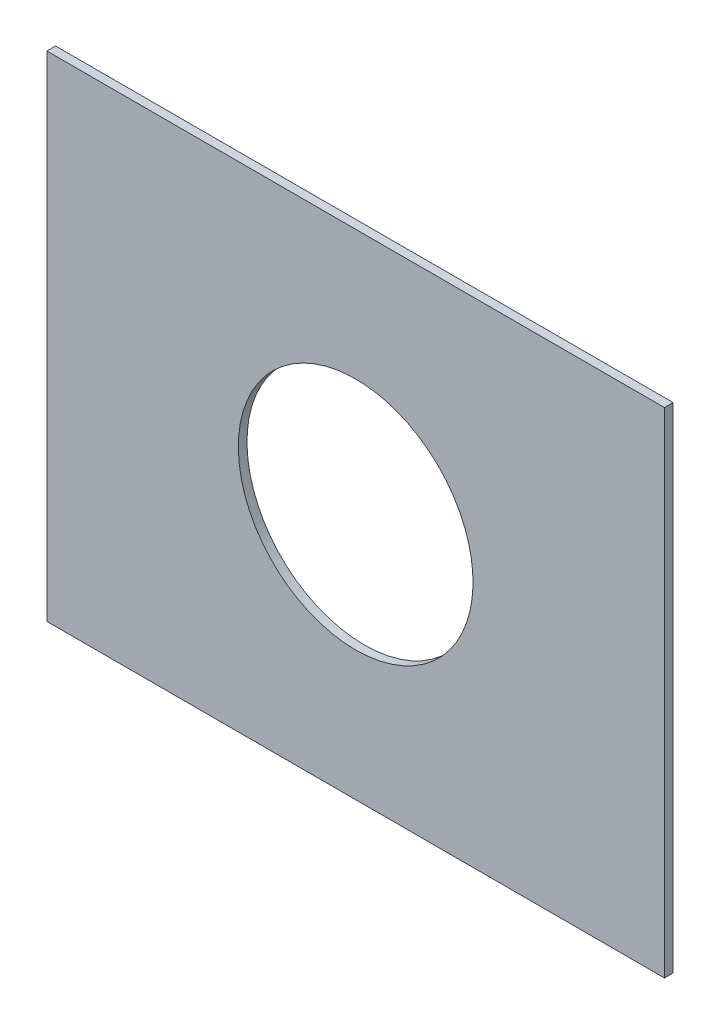
ISO-10303-21;
HEADER;
FILE_DESCRIPTION(('STEP AP214'),'2;1');
FILE_NAME('part.step','',(''),(''),'','','');
FILE_SCHEMA(('AUTOMOTIVE_DESIGN { 1 0 10303 214 1 1 1 1 }'));
ENDSEC;
DATA;
#1=APPLICATION_CONTEXT('core data for automotive mechanical design processes');
#2=APPLICATION_PROTOCOL_DEFINITION('international standard','automotive_design',2000,#1);
#3=PRODUCT_CONTEXT('',#1,'mechanical');
#4=PRODUCT('Part','Part','',(#3));
#5=PRODUCT_RELATED_PRODUCT_CATEGORY('part','',(#4));
#6=PRODUCT_DEFINITION_FORMATION('','',#4);
#7=PRODUCT_DEFINITION_CONTEXT('part definition',#1,'design');
#8=PRODUCT_DEFINITION('design','',#6,#7);
#9=PRODUCT_DEFINITION_SHAPE('','',#8);
#10=(LENGTH_UNIT() NAMED_UNIT(*) SI_UNIT(.MILLI.,.METRE.));
#11=(NAMED_UNIT(*) PLANE_ANGLE_UNIT() SI_UNIT($,.RADIAN.));
#12=(NAMED_UNIT(*) SI_UNIT($,.STERADIAN.) SOLID_ANGLE_UNIT());
#13=UNCERTAINTY_MEASURE_WITH_UNIT(LENGTH_MEASURE(1.E-05),#10,'distance_accuracy_value','');
#14=(GEOMETRIC_REPRESENTATION_CONTEXT(3) GLOBAL_UNCERTAINTY_ASSIGNED_CONTEXT((#13)) GLOBAL_UNIT_ASSIGNED_CONTEXT((#10,
#11,#12)) REPRESENTATION_CONTEXT('',''));
#15=CARTESIAN_POINT('',(0.,0.,0.));
#16=DIRECTION('',(0.,0.,1.));
#17=DIRECTION('',(1.,0.,0.));
#18=AXIS2_PLACEMENT_3D('',#15,#16,#17);
#19=CARTESIAN_POINT('',(113.792,-122.169,-0.045));
#20=DIRECTION('',(0.,0.,-1.));
#21=DIRECTION('',(0.,-1.,0.));
#22=AXIS2_PLACEMENT_3D('',#19,#20,#21);
#23=CYLINDRICAL_SURFACE('',#22,0.475);
#24=CARTESIAN_POINT('',(113.792,-122.169,1.67));
#25=DIRECTION('',(0.,0.,-1.));
#26=DIRECTION('',(0.,-1.,0.));
#27=AXIS2_PLACEMENT_3D('',#24,#25,#26);
#28=CIRCLE('',#27,0.475);
#29=CARTESIAN_POINT('',(113.792,-122.644,1.67));
#30=VERTEX_POINT('',#29);
#31=EDGE_CURVE('E76',#30,#30,#28,.T.);
#32=ORIENTED_EDGE('',*,*,#31,.T.);
#33=DIRECTION('',(0.,0.,1.));
#34=VECTOR('',#33,1.);
#35=CARTESIAN_POINT('',(113.792,-122.644,-0.045));
#36=LINE('',#35,#34);
#37=CARTESIAN_POINT('',(113.792,-122.644,1.705));
#38=VERTEX_POINT('',#37);
#39=EDGE_CURVE('E11',#30,#38,#36,.T.);
#40=ORIENTED_EDGE('',*,*,#39,.T.);
#41=CARTESIAN_POINT('',(113.792,-122.169,1.705));
#42=DIRECTION('',(0.,0.,-1.));
#43=DIRECTION('',(0.,-1.,0.));
#44=AXIS2_PLACEMENT_3D('',#41,#42,#43);
#45=CIRCLE('',#44,0.475);
#46=EDGE_CURVE('E20',#38,#38,#45,.T.);
#47=ORIENTED_EDGE('',*,*,#46,.F.);
#48=ORIENTED_EDGE('',*,*,#39,.F.);
#49=EDGE_LOOP('',(#32,#40,#47,#48));
#50=FACE_BOUND('',#49,.T.);
#51=ADVANCED_FACE('F17',(#50),#23,.F.);
#52=CARTESIAN_POINT('',(112.542,-121.169,1.67));
#53=DIRECTION('',(0.,1.,0.));
#54=DIRECTION('',(1.,0.,0.));
#55=AXIS2_PLACEMENT_3D('',#52,#53,#54);
#56=PLANE('',#55);
#57=DIRECTION('',(0.,0.,1.));
#58=VECTOR('',#57,1.);
#59=CARTESIAN_POINT('',(112.542,-121.169,1.67));
#60=LINE('',#59,#58);
#61=CARTESIAN_POINT('',(112.542,-121.169,1.67));
#62=VERTEX_POINT('',#61);
#63=CARTESIAN_POINT('',(112.542,-121.169,1.705));
#64=VERTEX_POINT('',#63);
#65=EDGE_CURVE('E68',#62,#64,#60,.T.);
#66=ORIENTED_EDGE('',*,*,#65,.T.);
#67=DIRECTION('',(1.,0.,0.));
#68=VECTOR('',#67,1.);
#69=CARTESIAN_POINT('',(112.542,-121.169,1.705));
#70=LINE('',#69,#68);
#71=CARTESIAN_POINT('',(115.042,-121.169,1.705));
#72=VERTEX_POINT('',#71);
#73=EDGE_CURVE('E105',#64,#72,#70,.T.);
#74=ORIENTED_EDGE('',*,*,#73,.T.);
#75=DIRECTION('',(0.,0.,1.));
#76=VECTOR('',#75,1.);
#77=CARTESIAN_POINT('',(115.042,-121.169,1.67));
#78=LINE('',#77,#76);
#79=CARTESIAN_POINT('',(115.042,-121.169,1.67));
#80=VERTEX_POINT('',#79);
#81=EDGE_CURVE('E71',#80,#72,#78,.T.);
#82=ORIENTED_EDGE('',*,*,#81,.F.);
#83=DIRECTION('',(1.,0.,0.));
#84=VECTOR('',#83,1.);
#85=CARTESIAN_POINT('',(112.542,-121.169,1.67));
#86=LINE('',#85,#84);
#87=EDGE_CURVE('E63',#62,#80,#86,.T.);
#88=ORIENTED_EDGE('',*,*,#87,.F.);
#89=EDGE_LOOP('',(#66,#74,#82,#88));
#90=FACE_BOUND('',#89,.T.);
#91=ADVANCED_FACE('F65',(#90),#56,.T.);
#92=CARTESIAN_POINT('',(0.,0.,1.705));
#93=DIRECTION('',(0.,0.,1.));
#94=DIRECTION('',(1.,0.,0.));
#95=AXIS2_PLACEMENT_3D('',#92,#93,#94);
#96=PLANE('',#95);
#97=ORIENTED_EDGE('',*,*,#46,.T.);
#98=EDGE_LOOP('',(#97));
#99=FACE_BOUND('',#98,.T.);
#100=DIRECTION('',(-1.,0.,0.));
#101=VECTOR('',#100,1.);
#102=CARTESIAN_POINT('',(115.042,-123.169,1.705));
#103=LINE('',#102,#101);
#104=CARTESIAN_POINT('',(115.042,-123.169,1.705));
#105=VERTEX_POINT('',#104);
#106=CARTESIAN_POINT('',(112.542,-123.169,1.705));
#107=VERTEX_POINT('',#106);
#108=EDGE_CURVE('E232',#105,#107,#103,.T.);
#109=ORIENTED_EDGE('',*,*,#108,.F.);
#110=DIRECTION('',(0.,-1.,0.));
#111=VECTOR('',#110,1.);
#112=CARTESIAN_POINT('',(115.042,-121.169,1.705));
#113=LINE('',#112,#111);
#114=EDGE_CURVE('E102',#72,#105,#113,.T.);
#115=ORIENTED_EDGE('',*,*,#114,.F.);
#116=ORIENTED_EDGE('',*,*,#73,.F.);
#117=DIRECTION('',(0.,1.,0.));
#118=VECTOR('',#117,1.);
#119=CARTESIAN_POINT('',(112.542,-123.169,1.705));
#120=LINE('',#119,#118);
#121=EDGE_CURVE('E90',#107,#64,#120,.T.);
#122=ORIENTED_EDGE('',*,*,#121,.F.);
#123=EDGE_LOOP('',(#109,#115,#116,#122));
#124=FACE_BOUND('',#123,.T.);
#125=ADVANCED_FACE('F114',(#99,#124),#96,.T.);
#126=CARTESIAN_POINT('',(0.,0.,1.67));
#127=DIRECTION('',(0.,0.,1.));
#128=DIRECTION('',(1.,0.,0.));
#129=AXIS2_PLACEMENT_3D('',#126,#127,#128);
#130=PLANE('',#129);
#131=ORIENTED_EDGE('',*,*,#31,.F.);
#132=EDGE_LOOP('',(#131));
#133=FACE_BOUND('',#132,.T.);
#134=DIRECTION('',(0.,1.,0.));
#135=VECTOR('',#134,1.);
#136=CARTESIAN_POINT('',(112.542,-123.169,1.67));
#137=LINE('',#136,#135);
#138=CARTESIAN_POINT('',(112.542,-123.169,1.67));
#139=VERTEX_POINT('',#138);
#140=EDGE_CURVE('E77',#139,#62,#137,.T.);
#141=ORIENTED_EDGE('',*,*,#140,.T.);
#142=ORIENTED_EDGE('',*,*,#87,.T.);
#143=DIRECTION('',(0.,-1.,0.));
#144=VECTOR('',#143,1.);
#145=CARTESIAN_POINT('',(115.042,-121.169,1.67));
#146=LINE('',#145,#144);
#147=CARTESIAN_POINT('',(115.042,-123.169,1.67));
#148=VERTEX_POINT('',#147);
#149=EDGE_CURVE('E97',#80,#148,#146,.T.);
#150=ORIENTED_EDGE('',*,*,#149,.T.);
#151=DIRECTION('',(-1.,0.,0.));
#152=VECTOR('',#151,1.);
#153=CARTESIAN_POINT('',(115.042,-123.169,1.67));
#154=LINE('',#153,#152);
#155=EDGE_CURVE('E83',#148,#139,#154,.T.);
#156=ORIENTED_EDGE('',*,*,#155,.T.);
#157=EDGE_LOOP('',(#141,#142,#150,#156));
#158=FACE_BOUND('',#157,.T.);
#159=ADVANCED_FACE('F81',(#133,#158),#130,.F.);
#160=CARTESIAN_POINT('',(112.542,-123.169,1.67));
#161=DIRECTION('',(-1.,0.,0.));
#162=DIRECTION('',(0.,0.,1.));
#163=AXIS2_PLACEMENT_3D('',#160,#161,#162);
#164=PLANE('',#163);
#165=DIRECTION('',(0.,0.,1.));
#166=VECTOR('',#165,1.);
#167=CARTESIAN_POINT('',(112.542,-123.169,1.67));
#168=LINE('',#167,#166);
#169=EDGE_CURVE('E221',#139,#107,#168,.T.);
#170=ORIENTED_EDGE('',*,*,#169,.T.);
#171=ORIENTED_EDGE('',*,*,#121,.T.);
#172=ORIENTED_EDGE('',*,*,#65,.F.);
#173=ORIENTED_EDGE('',*,*,#140,.F.);
#174=EDGE_LOOP('',(#170,#171,#172,#173));
#175=FACE_BOUND('',#174,.T.);
#176=ADVANCED_FACE('F89',(#175),#164,.T.);
#177=CARTESIAN_POINT('',(115.042,-121.169,1.67));
#178=DIRECTION('',(1.,0.,0.));
#179=DIRECTION('',(0.,1.,0.));
#180=AXIS2_PLACEMENT_3D('',#177,#178,#179);
#181=PLANE('',#180);
#182=ORIENTED_EDGE('',*,*,#81,.T.);
#183=ORIENTED_EDGE('',*,*,#114,.T.);
#184=DIRECTION('',(0.,0.,1.));
#185=VECTOR('',#184,1.);
#186=CARTESIAN_POINT('',(115.042,-123.169,1.67));
#187=LINE('',#186,#185);
#188=EDGE_CURVE('E239',#148,#105,#187,.T.);
#189=ORIENTED_EDGE('',*,*,#188,.F.);
#190=ORIENTED_EDGE('',*,*,#149,.F.);
#191=EDGE_LOOP('',(#182,#183,#189,#190));
#192=FACE_BOUND('',#191,.T.);
#193=ADVANCED_FACE('F126',(#192),#181,.T.);
#194=CARTESIAN_POINT('',(115.042,-123.169,1.67));
#195=DIRECTION('',(0.,-1.,0.));
#196=DIRECTION('',(0.,0.,-1.));
#197=AXIS2_PLACEMENT_3D('',#194,#195,#196);
#198=PLANE('',#197);
#199=ORIENTED_EDGE('',*,*,#188,.T.);
#200=ORIENTED_EDGE('',*,*,#108,.T.);
#201=ORIENTED_EDGE('',*,*,#169,.F.);
#202=ORIENTED_EDGE('',*,*,#155,.F.);
#203=EDGE_LOOP('',(#199,#200,#201,#202));
#204=FACE_BOUND('',#203,.T.);
#205=ADVANCED_FACE('F180',(#204),#198,.T.);
#206=CLOSED_SHELL('',(#51,#91,#125,#159,#176,#193,#205));
#207=MANIFOLD_SOLID_BREP('B1',#206);
#208=ADVANCED_BREP_SHAPE_REPRESENTATION('',(#18,#207),#14);
#209=SHAPE_DEFINITION_REPRESENTATION(#9,#208);
ENDSEC;
END-ISO-10303-21;
